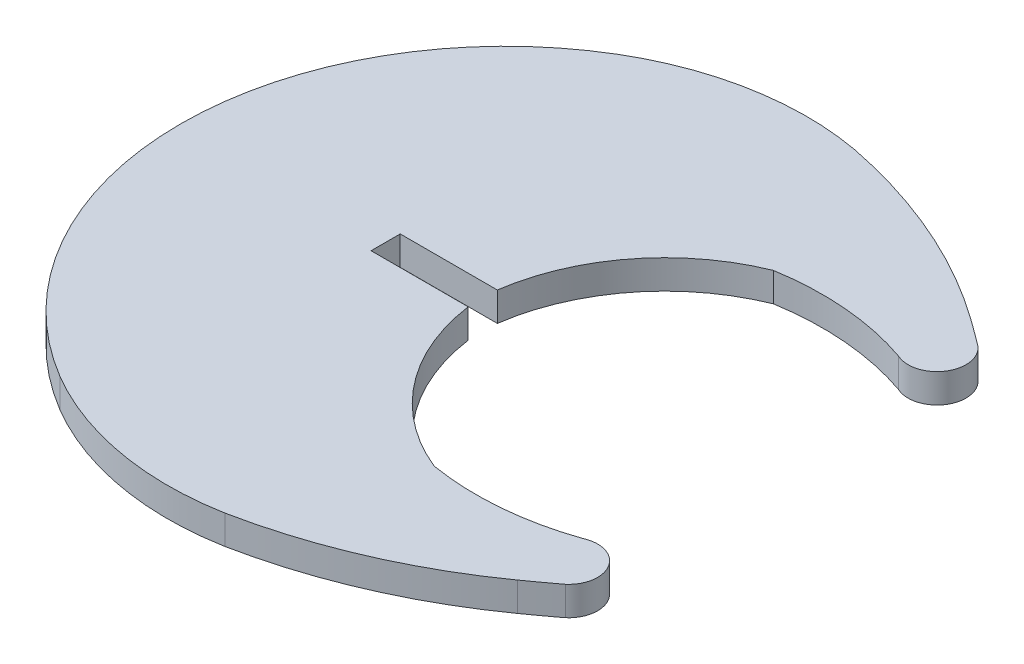
ISO-10303-21;
HEADER;
FILE_DESCRIPTION(('STEP AP214'),'2;1');
FILE_NAME('part.step','',(''),(''),'','','');
FILE_SCHEMA(('AUTOMOTIVE_DESIGN { 1 0 10303 214 1 1 1 1 }'));
ENDSEC;
DATA;
#1=APPLICATION_CONTEXT('core data for automotive mechanical design processes');
#2=APPLICATION_PROTOCOL_DEFINITION('international standard','automotive_design',2000,#1);
#3=PRODUCT_CONTEXT('',#1,'mechanical');
#4=PRODUCT('Part','Part','',(#3));
#5=PRODUCT_RELATED_PRODUCT_CATEGORY('part','',(#4));
#6=PRODUCT_DEFINITION_FORMATION('','',#4);
#7=PRODUCT_DEFINITION_CONTEXT('part definition',#1,'design');
#8=PRODUCT_DEFINITION('design','',#6,#7);
#9=PRODUCT_DEFINITION_SHAPE('','',#8);
#10=(LENGTH_UNIT() NAMED_UNIT(*) SI_UNIT(.MILLI.,.METRE.));
#11=(NAMED_UNIT(*) PLANE_ANGLE_UNIT() SI_UNIT($,.RADIAN.));
#12=(NAMED_UNIT(*) SI_UNIT($,.STERADIAN.) SOLID_ANGLE_UNIT());
#13=UNCERTAINTY_MEASURE_WITH_UNIT(LENGTH_MEASURE(1.E-05),#10,'distance_accuracy_value','');
#14=(GEOMETRIC_REPRESENTATION_CONTEXT(3) GLOBAL_UNCERTAINTY_ASSIGNED_CONTEXT((#13)) GLOBAL_UNIT_ASSIGNED_CONTEXT((#10,
#11,#12)) REPRESENTATION_CONTEXT('',''));
#15=CARTESIAN_POINT('',(0.,0.,0.));
#16=DIRECTION('',(0.,0.,1.));
#17=DIRECTION('',(1.,0.,0.));
#18=AXIS2_PLACEMENT_3D('',#15,#16,#17);
#19=CARTESIAN_POINT('',(192.858803309642,1.45,-211.003432840916));
#20=DIRECTION('',(0.,-1.,0.));
#21=DIRECTION('',(0.,0.,-1.));
#22=AXIS2_PLACEMENT_3D('',#19,#20,#21);
#23=CYLINDRICAL_SURFACE('',#22,13.975797644001);
#24=CARTESIAN_POINT('',(192.858803309642,0.,-211.003432840916));
#25=DIRECTION('',(0.,1.,0.));
#26=DIRECTION('',(0.,0.,1.));
#27=AXIS2_PLACEMENT_3D('',#24,#25,#26);
#28=CIRCLE('',#27,13.975797644001);
#29=CARTESIAN_POINT('',(197.430421374458,0.,-224.210371473904));
#30=VERTEX_POINT('',#29);
#31=CARTESIAN_POINT('',(190.580696178935,0.,-224.79231052139));
#32=VERTEX_POINT('',#31);
#33=EDGE_CURVE('E179',#30,#32,#28,.T.);
#34=ORIENTED_EDGE('',*,*,#33,.F.);
#35=DIRECTION('',(0.,-1.,0.));
#36=VECTOR('',#35,1.);
#37=CARTESIAN_POINT('',(197.430421374458,1.45,-224.210371473904));
#38=LINE('',#37,#36);
#39=CARTESIAN_POINT('',(197.430421374458,1.45,-224.210371473904));
#40=VERTEX_POINT('',#39);
#41=EDGE_CURVE('E11',#40,#30,#38,.T.);
#42=ORIENTED_EDGE('',*,*,#41,.F.);
#43=CARTESIAN_POINT('',(192.858803309642,1.45,-211.003432840916));
#44=DIRECTION('',(0.,1.,0.));
#45=DIRECTION('',(0.,0.,1.));
#46=AXIS2_PLACEMENT_3D('',#43,#44,#45);
#47=CIRCLE('',#46,13.975797644001);
#48=CARTESIAN_POINT('',(190.580696178935,1.45,-224.79231052139));
#49=VERTEX_POINT('',#48);
#50=EDGE_CURVE('E215',#40,#49,#47,.T.);
#51=ORIENTED_EDGE('',*,*,#50,.T.);
#52=DIRECTION('',(0.,-1.,0.));
#53=VECTOR('',#52,1.);
#54=CARTESIAN_POINT('',(190.580696178935,1.45,-224.79231052139));
#55=LINE('',#54,#53);
#56=EDGE_CURVE('E53',#49,#32,#55,.T.);
#57=ORIENTED_EDGE('',*,*,#56,.T.);
#58=EDGE_LOOP('',(#34,#42,#51,#57));
#59=FACE_BOUND('',#58,.T.);
#60=ADVANCED_FACE('F37',(#59),#23,.F.);
#61=CARTESIAN_POINT('',(198.041226903433,1.45,-225.526385971572));
#62=DIRECTION('',(0.,-1.,0.));
#63=DIRECTION('',(0.,0.,-1.));
#64=AXIS2_PLACEMENT_3D('',#61,#62,#63);
#65=CYLINDRICAL_SURFACE('',#64,1.45085407684621);
#66=CARTESIAN_POINT('',(198.041226903433,0.,-225.526385971572));
#67=DIRECTION('',(0.,1.,0.));
#68=DIRECTION('',(0.,0.,1.));
#69=AXIS2_PLACEMENT_3D('',#66,#67,#68);
#70=CIRCLE('',#69,1.45085407684621);
#71=CARTESIAN_POINT('',(198.987760342805,0.,-226.625954978253));
#72=VERTEX_POINT('',#71);
#73=EDGE_CURVE('E181',#30,#72,#70,.T.);
#74=ORIENTED_EDGE('',*,*,#73,.T.);
#75=DIRECTION('',(0.,-1.,0.));
#76=VECTOR('',#75,1.);
#77=CARTESIAN_POINT('',(198.987760342805,1.45,-226.625954978253));
#78=LINE('',#77,#76);
#79=CARTESIAN_POINT('',(198.987760342805,1.45,-226.625954978253));
#80=VERTEX_POINT('',#79);
#81=EDGE_CURVE('E45',#80,#72,#78,.T.);
#82=ORIENTED_EDGE('',*,*,#81,.F.);
#83=CARTESIAN_POINT('',(198.041226903433,1.45,-225.526385971572));
#84=DIRECTION('',(0.,1.,0.));
#85=DIRECTION('',(0.,0.,1.));
#86=AXIS2_PLACEMENT_3D('',#83,#84,#85);
#87=CIRCLE('',#86,1.45085407684621);
#88=EDGE_CURVE('E467',#40,#80,#87,.T.);
#89=ORIENTED_EDGE('',*,*,#88,.F.);
#90=ORIENTED_EDGE('',*,*,#41,.T.);
#91=EDGE_LOOP('',(#74,#82,#89,#90));
#92=FACE_BOUND('',#91,.T.);
#93=ADVANCED_FACE('F305',(#92),#65,.T.);
#94=CARTESIAN_POINT('',(161.13873268564,1.45,-176.4961104359));
#95=DIRECTION('',(0.,-1.,0.));
#96=DIRECTION('',(0.,0.,-1.));
#97=AXIS2_PLACEMENT_3D('',#94,#95,#96);
#98=CYLINDRICAL_SURFACE('',#97,62.813614833357);
#99=CARTESIAN_POINT('',(161.13873268564,0.,-176.4961104359));
#100=DIRECTION('',(0.,1.,0.));
#101=DIRECTION('',(0.,0.,1.));
#102=AXIS2_PLACEMENT_3D('',#99,#100,#101);
#103=CIRCLE('',#102,62.813614833357);
#104=CARTESIAN_POINT('',(197.59603014162,0.,-227.647021186731));
#105=VERTEX_POINT('',#104);
#106=EDGE_CURVE('E183',#72,#105,#103,.T.);
#107=ORIENTED_EDGE('',*,*,#106,.T.);
#108=DIRECTION('',(0.,-1.,0.));
#109=VECTOR('',#108,1.);
#110=CARTESIAN_POINT('',(197.59603014162,1.45,-227.647021186731));
#111=LINE('',#110,#109);
#112=CARTESIAN_POINT('',(197.59603014162,1.45,-227.647021186731));
#113=VERTEX_POINT('',#112);
#114=EDGE_CURVE('E243',#113,#105,#111,.T.);
#115=ORIENTED_EDGE('',*,*,#114,.F.);
#116=CARTESIAN_POINT('',(161.13873268564,1.45,-176.4961104359));
#117=DIRECTION('',(0.,1.,0.));
#118=DIRECTION('',(0.,0.,1.));
#119=AXIS2_PLACEMENT_3D('',#116,#117,#118);
#120=CIRCLE('',#119,62.813614833357);
#121=EDGE_CURVE('E252',#80,#113,#120,.T.);
#122=ORIENTED_EDGE('',*,*,#121,.F.);
#123=ORIENTED_EDGE('',*,*,#81,.T.);
#124=EDGE_LOOP('',(#107,#115,#122,#123));
#125=FACE_BOUND('',#124,.T.);
#126=ADVANCED_FACE('F250',(#125),#98,.T.);
#127=CARTESIAN_POINT('',(182.19906973308,1.45,-206.044521743805));
#128=DIRECTION('',(0.,-1.,0.));
#129=DIRECTION('',(0.,0.,-1.));
#130=AXIS2_PLACEMENT_3D('',#127,#128,#129);
#131=CYLINDRICAL_SURFACE('',#130,26.52799223469);
#132=CARTESIAN_POINT('',(182.19906973308,0.,-206.044521743805));
#133=DIRECTION('',(0.,1.,0.));
#134=DIRECTION('',(0.,0.,1.));
#135=AXIS2_PLACEMENT_3D('',#132,#133,#134);
#136=CIRCLE('',#135,26.52799223469);
#137=CARTESIAN_POINT('',(187.381791914213,0.,-232.061319448307));
#138=VERTEX_POINT('',#137);
#139=EDGE_CURVE('E185',#105,#138,#136,.T.);
#140=ORIENTED_EDGE('',*,*,#139,.T.);
#141=DIRECTION('',(0.,-1.,0.));
#142=VECTOR('',#141,1.);
#143=CARTESIAN_POINT('',(187.381791914213,1.45,-232.061319448307));
#144=LINE('',#143,#142);
#145=CARTESIAN_POINT('',(187.381791914213,1.45,-232.061319448307));
#146=VERTEX_POINT('',#145);
#147=EDGE_CURVE('E240',#146,#138,#144,.T.);
#148=ORIENTED_EDGE('',*,*,#147,.F.);
#149=CARTESIAN_POINT('',(182.19906973308,1.45,-206.044521743805));
#150=DIRECTION('',(0.,1.,0.));
#151=DIRECTION('',(0.,0.,1.));
#152=AXIS2_PLACEMENT_3D('',#149,#150,#151);
#153=CIRCLE('',#152,26.52799223469);
#154=EDGE_CURVE('E271',#113,#146,#153,.T.);
#155=ORIENTED_EDGE('',*,*,#154,.F.);
#156=ORIENTED_EDGE('',*,*,#114,.T.);
#157=EDGE_LOOP('',(#140,#148,#155,#156));
#158=FACE_BOUND('',#157,.T.);
#159=ADVANCED_FACE('F262',(#158),#131,.T.);
#160=CARTESIAN_POINT('',(184.747560160189,1.45,-217.738871268614));
#161=DIRECTION('',(0.,-1.,0.));
#162=DIRECTION('',(0.,0.,-1.));
#163=AXIS2_PLACEMENT_3D('',#160,#161,#162);
#164=CYLINDRICAL_SURFACE('',#163,14.562681717111);
#165=CARTESIAN_POINT('',(184.747560160189,0.,-217.738871268614));
#166=DIRECTION('',(0.,1.,0.));
#167=DIRECTION('',(0.,0.,1.));
#168=AXIS2_PLACEMENT_3D('',#165,#166,#167);
#169=CIRCLE('',#168,14.562681717111);
#170=CARTESIAN_POINT('',(177.319158958956,0.,-230.264467237964));
#171=VERTEX_POINT('',#170);
#172=EDGE_CURVE('E187',#138,#171,#169,.T.);
#173=ORIENTED_EDGE('',*,*,#172,.T.);
#174=DIRECTION('',(0.,-1.,0.));
#175=VECTOR('',#174,1.);
#176=CARTESIAN_POINT('',(177.319158958956,1.45,-230.264467237964));
#177=LINE('',#176,#175);
#178=CARTESIAN_POINT('',(177.319158958956,1.45,-230.264467237964));
#179=VERTEX_POINT('',#178);
#180=EDGE_CURVE('E237',#179,#171,#177,.T.);
#181=ORIENTED_EDGE('',*,*,#180,.F.);
#182=CARTESIAN_POINT('',(184.747560160189,1.45,-217.738871268614));
#183=DIRECTION('',(0.,1.,0.));
#184=DIRECTION('',(0.,0.,1.));
#185=AXIS2_PLACEMENT_3D('',#182,#183,#184);
#186=CIRCLE('',#185,14.562681717111);
#187=EDGE_CURVE('E268',#146,#179,#186,.T.);
#188=ORIENTED_EDGE('',*,*,#187,.F.);
#189=ORIENTED_EDGE('',*,*,#147,.T.);
#190=EDGE_LOOP('',(#173,#181,#188,#189));
#191=FACE_BOUND('',#190,.T.);
#192=ADVANCED_FACE('F266',(#191),#164,.T.);
#193=CARTESIAN_POINT('',(185.654167545236,1.45,-216.306889294792));
#194=DIRECTION('',(0.,-1.,0.));
#195=DIRECTION('',(0.,0.,-1.));
#196=AXIS2_PLACEMENT_3D('',#193,#194,#195);
#197=CYLINDRICAL_SURFACE('',#196,16.256886238548);
#198=CARTESIAN_POINT('',(185.654167545236,0.,-216.306889294792));
#199=DIRECTION('',(0.,1.,0.));
#200=DIRECTION('',(0.,0.,1.));
#201=AXIS2_PLACEMENT_3D('',#198,#199,#200);
#202=CIRCLE('',#201,16.256886238548);
#203=CARTESIAN_POINT('',(177.319161181418,0.,-202.349310024439));
#204=VERTEX_POINT('',#203);
#205=EDGE_CURVE('E189',#171,#204,#202,.T.);
#206=ORIENTED_EDGE('',*,*,#205,.T.);
#207=DIRECTION('',(0.,-1.,0.));
#208=VECTOR('',#207,1.);
#209=CARTESIAN_POINT('',(177.319161181418,1.45,-202.349310024439));
#210=LINE('',#209,#208);
#211=CARTESIAN_POINT('',(177.319161181418,1.45,-202.349310024439));
#212=VERTEX_POINT('',#211);
#213=EDGE_CURVE('E234',#212,#204,#210,.T.);
#214=ORIENTED_EDGE('',*,*,#213,.F.);
#215=CARTESIAN_POINT('',(185.654167545236,1.45,-216.306889294792));
#216=DIRECTION('',(0.,1.,0.));
#217=DIRECTION('',(0.,0.,1.));
#218=AXIS2_PLACEMENT_3D('',#215,#216,#217);
#219=CIRCLE('',#218,16.256886238548);
#220=EDGE_CURVE('E270',#179,#212,#219,.T.);
#221=ORIENTED_EDGE('',*,*,#220,.F.);
#222=ORIENTED_EDGE('',*,*,#180,.T.);
#223=EDGE_LOOP('',(#206,#214,#221,#222));
#224=FACE_BOUND('',#223,.T.);
#225=ADVANCED_FACE('F318',(#224),#197,.T.);
#226=CARTESIAN_POINT('',(184.747559553716,1.45,-214.874907671509));
#227=DIRECTION('',(0.,-1.,0.));
#228=DIRECTION('',(0.,0.,-1.));
#229=AXIS2_PLACEMENT_3D('',#226,#227,#228);
#230=CYLINDRICAL_SURFACE('',#229,14.56268171711);
#231=CARTESIAN_POINT('',(184.747559553716,0.,-214.874907671509));
#232=DIRECTION('',(0.,1.,0.));
#233=DIRECTION('',(0.,0.,1.));
#234=AXIS2_PLACEMENT_3D('',#231,#232,#233);
#235=CIRCLE('',#234,14.56268171711);
#236=CARTESIAN_POINT('',(187.381791945059,0.,-200.552459609036));
#237=VERTEX_POINT('',#236);
#238=EDGE_CURVE('E191',#204,#237,#235,.T.);
#239=ORIENTED_EDGE('',*,*,#238,.T.);
#240=DIRECTION('',(0.,-1.,0.));
#241=VECTOR('',#240,1.);
#242=CARTESIAN_POINT('',(187.381791945059,1.45,-200.552459609036));
#243=LINE('',#242,#241);
#244=CARTESIAN_POINT('',(187.381791945059,1.45,-200.552459609036));
#245=VERTEX_POINT('',#244);
#246=EDGE_CURVE('E231',#245,#237,#243,.T.);
#247=ORIENTED_EDGE('',*,*,#246,.F.);
#248=CARTESIAN_POINT('',(184.747559553716,1.45,-214.874907671509));
#249=DIRECTION('',(0.,1.,0.));
#250=DIRECTION('',(0.,0.,1.));
#251=AXIS2_PLACEMENT_3D('',#248,#249,#250);
#252=CIRCLE('',#251,14.56268171711);
#253=EDGE_CURVE('E273',#212,#245,#252,.T.);
#254=ORIENTED_EDGE('',*,*,#253,.F.);
#255=ORIENTED_EDGE('',*,*,#213,.T.);
#256=EDGE_LOOP('',(#239,#247,#254,#255));
#257=FACE_BOUND('',#256,.T.);
#258=ADVANCED_FACE('F321',(#257),#230,.T.);
#259=CARTESIAN_POINT('',(182.199069550858,1.45,-226.569257271093));
#260=DIRECTION('',(0.,-1.,0.));
#261=DIRECTION('',(0.,0.,-1.));
#262=AXIS2_PLACEMENT_3D('',#259,#260,#261);
#263=CYLINDRICAL_SURFACE('',#262,26.52799223469);
#264=CARTESIAN_POINT('',(182.199069550858,0.,-226.569257271093));
#265=DIRECTION('',(0.,1.,0.));
#266=DIRECTION('',(0.,0.,1.));
#267=AXIS2_PLACEMENT_3D('',#264,#265,#266);
#268=CIRCLE('',#267,26.52799223469);
#269=CARTESIAN_POINT('',(197.596031258513,0.,-204.966758754097));
#270=VERTEX_POINT('',#269);
#271=EDGE_CURVE('E193',#237,#270,#268,.T.);
#272=ORIENTED_EDGE('',*,*,#271,.T.);
#273=DIRECTION('',(0.,-1.,0.));
#274=VECTOR('',#273,1.);
#275=CARTESIAN_POINT('',(197.596031258513,1.45,-204.966758754097));
#276=LINE('',#275,#274);
#277=CARTESIAN_POINT('',(197.596031258513,1.45,-204.966758754097));
#278=VERTEX_POINT('',#277);
#279=EDGE_CURVE('E228',#278,#270,#276,.T.);
#280=ORIENTED_EDGE('',*,*,#279,.F.);
#281=CARTESIAN_POINT('',(182.199069550858,1.45,-226.569257271093));
#282=DIRECTION('',(0.,1.,0.));
#283=DIRECTION('',(0.,0.,1.));
#284=AXIS2_PLACEMENT_3D('',#281,#282,#283);
#285=CIRCLE('',#284,26.52799223469);
#286=EDGE_CURVE('E279',#245,#278,#285,.T.);
#287=ORIENTED_EDGE('',*,*,#286,.F.);
#288=ORIENTED_EDGE('',*,*,#246,.T.);
#289=EDGE_LOOP('',(#272,#280,#287,#288));
#290=FACE_BOUND('',#289,.T.);
#291=ADVANCED_FACE('F325',(#290),#263,.T.);
#292=CARTESIAN_POINT('',(161.138736211853,1.45,-256.117671222148));
#293=DIRECTION('',(0.,-1.,0.));
#294=DIRECTION('',(0.,0.,-1.));
#295=AXIS2_PLACEMENT_3D('',#292,#293,#294);
#296=CYLINDRICAL_SURFACE('',#295,62.813614833357);
#297=CARTESIAN_POINT('',(161.138736211853,0.,-256.117671222148));
#298=DIRECTION('',(0.,1.,0.));
#299=DIRECTION('',(0.,0.,1.));
#300=AXIS2_PLACEMENT_3D('',#297,#298,#299);
#301=CIRCLE('',#300,62.813614833357);
#302=CARTESIAN_POINT('',(198.987759558607,0.,-205.987823425349));
#303=VERTEX_POINT('',#302);
#304=EDGE_CURVE('E195',#270,#303,#301,.T.);
#305=ORIENTED_EDGE('',*,*,#304,.T.);
#306=DIRECTION('',(0.,-1.,0.));
#307=VECTOR('',#306,1.);
#308=CARTESIAN_POINT('',(198.987759558607,1.45,-205.987823425349));
#309=LINE('',#308,#307);
#310=CARTESIAN_POINT('',(198.987759558607,1.45,-205.987823425349));
#311=VERTEX_POINT('',#310);
#312=EDGE_CURVE('E225',#311,#303,#309,.T.);
#313=ORIENTED_EDGE('',*,*,#312,.F.);
#314=CARTESIAN_POINT('',(161.138736211853,1.45,-256.117671222148));
#315=DIRECTION('',(0.,1.,0.));
#316=DIRECTION('',(0.,0.,1.));
#317=AXIS2_PLACEMENT_3D('',#314,#315,#316);
#318=CIRCLE('',#317,62.813614833357);
#319=EDGE_CURVE('E281',#278,#311,#318,.T.);
#320=ORIENTED_EDGE('',*,*,#319,.F.);
#321=ORIENTED_EDGE('',*,*,#279,.T.);
#322=EDGE_LOOP('',(#305,#313,#320,#321));
#323=FACE_BOUND('',#322,.T.);
#324=ADVANCED_FACE('F329',(#323),#296,.T.);
#325=CARTESIAN_POINT('',(198.041226454564,1.45,-207.087392720688));
#326=DIRECTION('',(0.,-1.,0.));
#327=DIRECTION('',(0.,0.,-1.));
#328=AXIS2_PLACEMENT_3D('',#325,#326,#327);
#329=CYLINDRICAL_SURFACE('',#328,1.45085407684611);
#330=CARTESIAN_POINT('',(198.041226454564,0.,-207.087392720688));
#331=DIRECTION('',(0.,1.,0.));
#332=DIRECTION('',(0.,0.,1.));
#333=AXIS2_PLACEMENT_3D('',#330,#331,#332);
#334=CIRCLE('',#333,1.45085407684611);
#335=CARTESIAN_POINT('',(197.43042132852,0.,-208.40340740537));
#336=VERTEX_POINT('',#335);
#337=EDGE_CURVE('E197',#303,#336,#334,.T.);
#338=ORIENTED_EDGE('',*,*,#337,.T.);
#339=DIRECTION('',(0.,-1.,0.));
#340=VECTOR('',#339,1.);
#341=CARTESIAN_POINT('',(197.43042132852,1.45,-208.40340740537));
#342=LINE('',#341,#340);
#343=CARTESIAN_POINT('',(197.43042132852,1.45,-208.40340740537));
#344=VERTEX_POINT('',#343);
#345=EDGE_CURVE('E223',#344,#336,#342,.T.);
#346=ORIENTED_EDGE('',*,*,#345,.F.);
#347=CARTESIAN_POINT('',(198.041226454564,1.45,-207.087392720688));
#348=DIRECTION('',(0.,1.,0.));
#349=DIRECTION('',(0.,0.,1.));
#350=AXIS2_PLACEMENT_3D('',#347,#348,#349);
#351=CIRCLE('',#350,1.45085407684611);
#352=EDGE_CURVE('E283',#311,#344,#351,.T.);
#353=ORIENTED_EDGE('',*,*,#352,.F.);
#354=ORIENTED_EDGE('',*,*,#312,.T.);
#355=EDGE_LOOP('',(#338,#346,#353,#354));
#356=FACE_BOUND('',#355,.T.);
#357=ADVANCED_FACE('F333',(#356),#329,.T.);
#358=CARTESIAN_POINT('',(192.858803912593,1.45,-221.610346491727));
#359=DIRECTION('',(0.,-1.,0.));
#360=DIRECTION('',(0.,0.,-1.));
#361=AXIS2_PLACEMENT_3D('',#358,#359,#360);
#362=CYLINDRICAL_SURFACE('',#361,13.9757978601708);
#363=CARTESIAN_POINT('',(192.858803912593,0.,-221.610346491727));
#364=DIRECTION('',(0.,1.,0.));
#365=DIRECTION('',(0.,0.,1.));
#366=AXIS2_PLACEMENT_3D('',#363,#364,#365);
#367=CIRCLE('',#366,13.9757978601708);
#368=CARTESIAN_POINT('',(190.580696475648,0.,-207.821468642747));
#369=VERTEX_POINT('',#368);
#370=EDGE_CURVE('E200',#369,#336,#367,.T.);
#371=ORIENTED_EDGE('',*,*,#370,.F.);
#372=DIRECTION('',(0.,-1.,0.));
#373=VECTOR('',#372,1.);
#374=CARTESIAN_POINT('',(190.580696475648,1.45,-207.821468642747));
#375=LINE('',#374,#373);
#376=CARTESIAN_POINT('',(190.580696475648,1.45,-207.821468642747));
#377=VERTEX_POINT('',#376);
#378=EDGE_CURVE('E221',#377,#369,#375,.T.);
#379=ORIENTED_EDGE('',*,*,#378,.F.);
#380=CARTESIAN_POINT('',(192.858803912593,1.45,-221.610346491727));
#381=DIRECTION('',(0.,1.,0.));
#382=DIRECTION('',(0.,0.,1.));
#383=AXIS2_PLACEMENT_3D('',#380,#381,#382);
#384=CIRCLE('',#383,13.9757978601708);
#385=EDGE_CURVE('E285',#377,#344,#384,.T.);
#386=ORIENTED_EDGE('',*,*,#385,.T.);
#387=ORIENTED_EDGE('',*,*,#345,.T.);
#388=EDGE_LOOP('',(#371,#379,#386,#387));
#389=FACE_BOUND('',#388,.T.);
#390=ADVANCED_FACE('F337',(#389),#362,.F.);
#391=CARTESIAN_POINT('',(194.285104944953,1.45,-216.957614862529));
#392=DIRECTION('',(0.,-1.,0.));
#393=DIRECTION('',(0.,0.,-1.));
#394=AXIS2_PLACEMENT_3D('',#391,#392,#393);
#395=CYLINDRICAL_SURFACE('',#394,9.8585906628027);
#396=CARTESIAN_POINT('',(194.285104944953,0.,-216.957614862529));
#397=DIRECTION('',(0.,1.,0.));
#398=DIRECTION('',(0.,0.,1.));
#399=AXIS2_PLACEMENT_3D('',#396,#397,#398);
#400=CIRCLE('',#399,9.8585906628027);
#401=CARTESIAN_POINT('',(184.52353921712,0.,-215.57788865857));
#402=VERTEX_POINT('',#401);
#403=EDGE_CURVE('E203',#402,#369,#400,.T.);
#404=ORIENTED_EDGE('',*,*,#403,.F.);
#405=DIRECTION('',(0.,-1.,0.));
#406=VECTOR('',#405,1.);
#407=CARTESIAN_POINT('',(184.52353921712,1.45,-215.57788865857));
#408=LINE('',#407,#406);
#409=CARTESIAN_POINT('',(184.52353921712,1.45,-215.57788865857));
#410=VERTEX_POINT('',#409);
#411=EDGE_CURVE('E219',#410,#402,#408,.T.);
#412=ORIENTED_EDGE('',*,*,#411,.F.);
#413=CARTESIAN_POINT('',(194.285104944953,1.45,-216.957614862529));
#414=DIRECTION('',(0.,1.,0.));
#415=DIRECTION('',(0.,0.,1.));
#416=AXIS2_PLACEMENT_3D('',#413,#414,#415);
#417=CIRCLE('',#416,9.8585906628027);
#418=EDGE_CURVE('E288',#410,#377,#417,.T.);
#419=ORIENTED_EDGE('',*,*,#418,.T.);
#420=ORIENTED_EDGE('',*,*,#378,.T.);
#421=EDGE_LOOP('',(#404,#412,#419,#420));
#422=FACE_BOUND('',#421,.T.);
#423=ADVANCED_FACE('F341',(#422),#395,.F.);
#424=CARTESIAN_POINT('',(-48.360559474051,1.45,-215.57788865857));
#425=DIRECTION('',(0.,0.,-1.));
#426=DIRECTION('',(-1.,0.,0.));
#427=AXIS2_PLACEMENT_3D('',#424,#425,#426);
#428=PLANE('',#427);
#429=DIRECTION('',(1.,0.,0.));
#430=VECTOR('',#429,1.);
#431=CARTESIAN_POINT('',(-48.360559474051,0.,-215.57788865857));
#432=LINE('',#431,#430);
#433=CARTESIAN_POINT('',(179.6635335934,0.,-215.57788865857));
#434=VERTEX_POINT('',#433);
#435=EDGE_CURVE('E206',#434,#402,#432,.T.);
#436=ORIENTED_EDGE('',*,*,#435,.F.);
#437=DIRECTION('',(0.,-1.,0.));
#438=VECTOR('',#437,1.);
#439=CARTESIAN_POINT('',(179.6635335934,1.45,-215.57788865857));
#440=LINE('',#439,#438);
#441=CARTESIAN_POINT('',(179.6635335934,1.45,-215.57788865857));
#442=VERTEX_POINT('',#441);
#443=EDGE_CURVE('E171',#442,#434,#440,.T.);
#444=ORIENTED_EDGE('',*,*,#443,.F.);
#445=DIRECTION('',(1.,0.,0.));
#446=VECTOR('',#445,1.);
#447=CARTESIAN_POINT('',(-48.360559474051,1.45,-215.57788865857));
#448=LINE('',#447,#446);
#449=EDGE_CURVE('E161',#442,#410,#448,.T.);
#450=ORIENTED_EDGE('',*,*,#449,.T.);
#451=ORIENTED_EDGE('',*,*,#411,.T.);
#452=EDGE_LOOP('',(#436,#444,#450,#451));
#453=FACE_BOUND('',#452,.T.);
#454=ADVANCED_FACE('F292',(#453),#428,.T.);
#455=CARTESIAN_POINT('',(179.6635335934,1.45,-266.906670720934));
#456=DIRECTION('',(-1.,0.,0.));
#457=DIRECTION('',(0.,0.,1.));
#458=AXIS2_PLACEMENT_3D('',#455,#456,#457);
#459=PLANE('',#458);
#460=DIRECTION('',(0.,0.,-1.));
#461=VECTOR('',#460,1.);
#462=CARTESIAN_POINT('',(179.6635335934,0.,-266.906670720934));
#463=LINE('',#462,#461);
#464=CARTESIAN_POINT('',(179.6635335934,0.,-217.035890293852));
#465=VERTEX_POINT('',#464);
#466=EDGE_CURVE('E168',#434,#465,#463,.T.);
#467=ORIENTED_EDGE('',*,*,#466,.T.);
#468=DIRECTION('',(0.,-1.,0.));
#469=VECTOR('',#468,1.);
#470=CARTESIAN_POINT('',(179.6635335934,1.45,-217.035890293852));
#471=LINE('',#470,#469);
#472=CARTESIAN_POINT('',(179.6635335934,1.45,-217.035890293852));
#473=VERTEX_POINT('',#472);
#474=EDGE_CURVE('E165',#473,#465,#471,.T.);
#475=ORIENTED_EDGE('',*,*,#474,.F.);
#476=DIRECTION('',(0.,0.,-1.));
#477=VECTOR('',#476,1.);
#478=CARTESIAN_POINT('',(179.6635335934,1.45,-266.906670720934));
#479=LINE('',#478,#477);
#480=EDGE_CURVE('E152',#442,#473,#479,.T.);
#481=ORIENTED_EDGE('',*,*,#480,.F.);
#482=ORIENTED_EDGE('',*,*,#443,.T.);
#483=EDGE_LOOP('',(#467,#475,#481,#482));
#484=FACE_BOUND('',#483,.T.);
#485=ADVANCED_FACE('F166',(#484),#459,.F.);
#486=CARTESIAN_POINT('',(-48.3605685869137,1.45,-217.035931960617));
#487=DIRECTION('',(1.82729650053615E-07,0.,-0.999999999999983));
#488=DIRECTION('',(-0.999999999999983,0.,-1.82729650053615E-07));
#489=AXIS2_PLACEMENT_3D('',#486,#487,#488);
#490=PLANE('',#489);
#491=DIRECTION('',(0.999999999999983,0.,1.82729650053615E-07));
#492=VECTOR('',#491,1.);
#493=CARTESIAN_POINT('',(-48.3605685869137,0.,-217.035931960617));
#494=LINE('',#493,#492);
#495=CARTESIAN_POINT('',(184.52353887481,0.,-217.035889405785));
#496=VERTEX_POINT('',#495);
#497=EDGE_CURVE('E210',#465,#496,#494,.T.);
#498=ORIENTED_EDGE('',*,*,#497,.T.);
#499=DIRECTION('',(0.,-1.,0.));
#500=VECTOR('',#499,1.);
#501=CARTESIAN_POINT('',(184.52353887481,1.45,-217.035889405785));
#502=LINE('',#501,#500);
#503=CARTESIAN_POINT('',(184.52353887481,1.45,-217.035889405785));
#504=VERTEX_POINT('',#503);
#505=EDGE_CURVE('E103',#504,#496,#502,.T.);
#506=ORIENTED_EDGE('',*,*,#505,.F.);
#507=DIRECTION('',(0.999999999999983,0.,1.82729650053615E-07));
#508=VECTOR('',#507,1.);
#509=CARTESIAN_POINT('',(-48.3605685869137,1.45,-217.035931960617));
#510=LINE('',#509,#508);
#511=EDGE_CURVE('E158',#473,#504,#510,.T.);
#512=ORIENTED_EDGE('',*,*,#511,.F.);
#513=ORIENTED_EDGE('',*,*,#474,.T.);
#514=EDGE_LOOP('',(#498,#506,#512,#513));
#515=FACE_BOUND('',#514,.T.);
#516=ADVANCED_FACE('F173',(#515),#490,.F.);
#517=CARTESIAN_POINT('',(194.285104985787,1.45,-215.656164176256));
#518=DIRECTION('',(0.,-1.,0.));
#519=DIRECTION('',(0.,0.,-1.));
#520=AXIS2_PLACEMENT_3D('',#517,#518,#519);
#521=CYLINDRICAL_SURFACE('',#520,9.858590905803);
#522=CARTESIAN_POINT('',(194.285104985787,0.,-215.656164176256));
#523=DIRECTION('',(0.,1.,0.));
#524=DIRECTION('',(0.,0.,1.));
#525=AXIS2_PLACEMENT_3D('',#522,#523,#524);
#526=CIRCLE('',#525,9.858590905803);
#527=EDGE_CURVE('E212',#32,#496,#526,.T.);
#528=ORIENTED_EDGE('',*,*,#527,.F.);
#529=ORIENTED_EDGE('',*,*,#56,.F.);
#530=CARTESIAN_POINT('',(194.285104985787,1.45,-215.656164176256));
#531=DIRECTION('',(0.,1.,0.));
#532=DIRECTION('',(0.,0.,1.));
#533=AXIS2_PLACEMENT_3D('',#530,#531,#532);
#534=CIRCLE('',#533,9.858590905803);
#535=EDGE_CURVE('E174',#49,#504,#534,.T.);
#536=ORIENTED_EDGE('',*,*,#535,.T.);
#537=ORIENTED_EDGE('',*,*,#505,.T.);
#538=EDGE_LOOP('',(#528,#529,#536,#537));
#539=FACE_BOUND('',#538,.T.);
#540=ADVANCED_FACE('F294',(#539),#521,.F.);
#541=CARTESIAN_POINT('',(-48.360559474051,1.45,-266.906670720934));
#542=DIRECTION('',(0.,1.,0.));
#543=DIRECTION('',(0.,0.,1.));
#544=AXIS2_PLACEMENT_3D('',#541,#542,#543);
#545=PLANE('',#544);
#546=ORIENTED_EDGE('',*,*,#50,.F.);
#547=ORIENTED_EDGE('',*,*,#88,.T.);
#548=ORIENTED_EDGE('',*,*,#121,.T.);
#549=ORIENTED_EDGE('',*,*,#154,.T.);
#550=ORIENTED_EDGE('',*,*,#187,.T.);
#551=ORIENTED_EDGE('',*,*,#220,.T.);
#552=ORIENTED_EDGE('',*,*,#253,.T.);
#553=ORIENTED_EDGE('',*,*,#286,.T.);
#554=ORIENTED_EDGE('',*,*,#319,.T.);
#555=ORIENTED_EDGE('',*,*,#352,.T.);
#556=ORIENTED_EDGE('',*,*,#385,.F.);
#557=ORIENTED_EDGE('',*,*,#418,.F.);
#558=ORIENTED_EDGE('',*,*,#449,.F.);
#559=ORIENTED_EDGE('',*,*,#480,.T.);
#560=ORIENTED_EDGE('',*,*,#511,.T.);
#561=ORIENTED_EDGE('',*,*,#535,.F.);
#562=EDGE_LOOP('',(#546,#547,#548,#549,#550,#551,#552,#553,#554,#555,#556,#557,#558,#559,#560,#561));
#563=FACE_BOUND('',#562,.T.);
#564=ADVANCED_FACE('F155',(#563),#545,.T.);
#565=CARTESIAN_POINT('',(-48.360559474051,0.,-266.906670720934));
#566=DIRECTION('',(0.,1.,0.));
#567=DIRECTION('',(0.,0.,1.));
#568=AXIS2_PLACEMENT_3D('',#565,#566,#567);
#569=PLANE('',#568);
#570=ORIENTED_EDGE('',*,*,#33,.T.);
#571=ORIENTED_EDGE('',*,*,#527,.T.);
#572=ORIENTED_EDGE('',*,*,#497,.F.);
#573=ORIENTED_EDGE('',*,*,#466,.F.);
#574=ORIENTED_EDGE('',*,*,#435,.T.);
#575=ORIENTED_EDGE('',*,*,#403,.T.);
#576=ORIENTED_EDGE('',*,*,#370,.T.);
#577=ORIENTED_EDGE('',*,*,#337,.F.);
#578=ORIENTED_EDGE('',*,*,#304,.F.);
#579=ORIENTED_EDGE('',*,*,#271,.F.);
#580=ORIENTED_EDGE('',*,*,#238,.F.);
#581=ORIENTED_EDGE('',*,*,#205,.F.);
#582=ORIENTED_EDGE('',*,*,#172,.F.);
#583=ORIENTED_EDGE('',*,*,#139,.F.);
#584=ORIENTED_EDGE('',*,*,#106,.F.);
#585=ORIENTED_EDGE('',*,*,#73,.F.);
#586=EDGE_LOOP('',(#570,#571,#572,#573,#574,#575,#576,#577,#578,#579,#580,#581,#582,#583,#584,#585));
#587=FACE_BOUND('',#586,.T.);
#588=ADVANCED_FACE('F257',(#587),#569,.F.);
#589=CLOSED_SHELL('',(#60,#93,#126,#159,#192,#225,#258,#291,#324,#357,#390,#423,#454,#485,#516,
#540,#564,#588));
#590=MANIFOLD_SOLID_BREP('B2',#589);
#591=ADVANCED_BREP_SHAPE_REPRESENTATION('',(#18,#590),#14);
#592=SHAPE_DEFINITION_REPRESENTATION(#9,#591);
ENDSEC;
END-ISO-10303-21;
